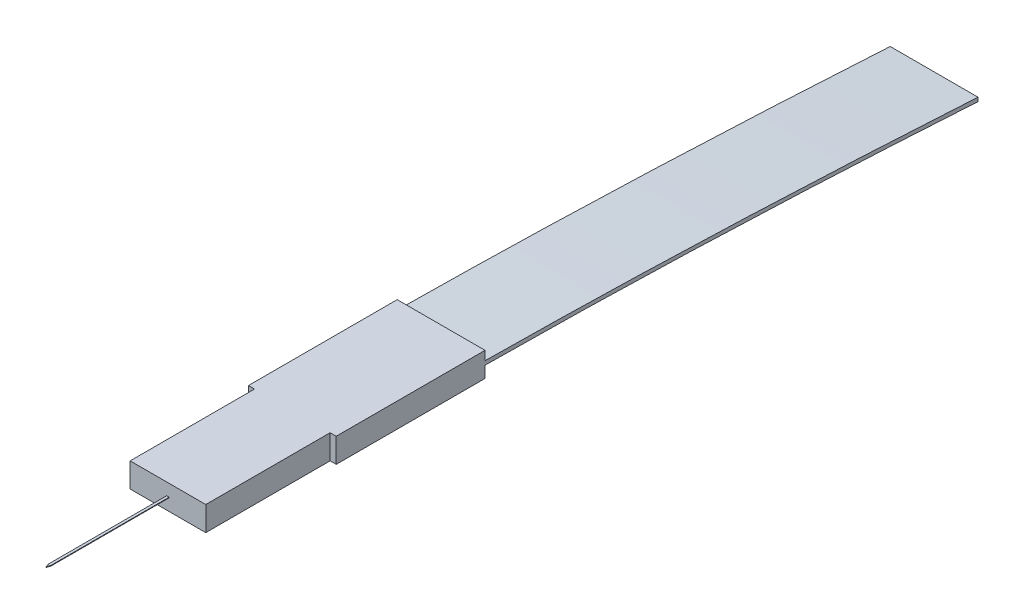
ISO-10303-21;
HEADER;
FILE_DESCRIPTION(('STEP AP214'),'2;1');
FILE_NAME('part.step','',(''),(''),'','','');
FILE_SCHEMA(('AUTOMOTIVE_DESIGN { 1 0 10303 214 1 1 1 1 }'));
ENDSEC;
DATA;
#1=APPLICATION_CONTEXT('core data for automotive mechanical design processes');
#2=APPLICATION_PROTOCOL_DEFINITION('international standard','automotive_design',2000,#1);
#3=PRODUCT_CONTEXT('',#1,'mechanical');
#4=PRODUCT('Part','Part','',(#3));
#5=PRODUCT_RELATED_PRODUCT_CATEGORY('part','',(#4));
#6=PRODUCT_DEFINITION_FORMATION('','',#4);
#7=PRODUCT_DEFINITION_CONTEXT('part definition',#1,'design');
#8=PRODUCT_DEFINITION('design','',#6,#7);
#9=PRODUCT_DEFINITION_SHAPE('','',#8);
#10=(LENGTH_UNIT() NAMED_UNIT(*) SI_UNIT(.MILLI.,.METRE.));
#11=(NAMED_UNIT(*) PLANE_ANGLE_UNIT() SI_UNIT($,.RADIAN.));
#12=(NAMED_UNIT(*) SI_UNIT($,.STERADIAN.) SOLID_ANGLE_UNIT());
#13=UNCERTAINTY_MEASURE_WITH_UNIT(LENGTH_MEASURE(1.E-05),#10,'distance_accuracy_value','');
#14=(GEOMETRIC_REPRESENTATION_CONTEXT(3) GLOBAL_UNCERTAINTY_ASSIGNED_CONTEXT((#13)) GLOBAL_UNIT_ASSIGNED_CONTEXT((#10,
#11,#12)) REPRESENTATION_CONTEXT('',''));
#15=CARTESIAN_POINT('',(0.,0.,0.));
#16=DIRECTION('',(0.,0.,1.));
#17=DIRECTION('',(1.,0.,0.));
#18=AXIS2_PLACEMENT_3D('',#15,#16,#17);
#19=CARTESIAN_POINT('',(0.,2.,-6.1));
#20=DIRECTION('',(0.,0.,-1.));
#21=DIRECTION('',(-1.,0.,0.));
#22=AXIS2_PLACEMENT_3D('',#19,#20,#21);
#23=PLANE('',#22);
#24=DIRECTION('',(0.,-1.,0.));
#25=VECTOR('',#24,1.);
#26=CARTESIAN_POINT('',(-3.6,2.,-6.1));
#27=LINE('',#26,#25);
#28=CARTESIAN_POINT('',(-3.6,0.94234822080572,-6.1));
#29=VERTEX_POINT('',#28);
#30=CARTESIAN_POINT('',(-3.6,0.,-6.1));
#31=VERTEX_POINT('',#30);
#32=EDGE_CURVE('E207',#29,#31,#27,.T.);
#33=ORIENTED_EDGE('',*,*,#32,.F.);
#34=DIRECTION('',(1.,0.,0.));
#35=VECTOR('',#34,1.);
#36=CARTESIAN_POINT('',(-3.6,0.94234822080572,-6.1));
#37=LINE('',#36,#35);
#38=CARTESIAN_POINT('',(3.6,0.94234822080572,-6.1));
#39=VERTEX_POINT('',#38);
#40=EDGE_CURVE('E198',#29,#39,#37,.T.);
#41=ORIENTED_EDGE('',*,*,#40,.T.);
#42=DIRECTION('',(0.,-1.,0.));
#43=VECTOR('',#42,1.);
#44=CARTESIAN_POINT('',(3.6,2.,-6.1));
#45=LINE('',#44,#43);
#46=CARTESIAN_POINT('',(3.6,0.,-6.1));
#47=VERTEX_POINT('',#46);
#48=EDGE_CURVE('E206',#39,#47,#45,.T.);
#49=ORIENTED_EDGE('',*,*,#48,.T.);
#50=DIRECTION('',(1.,0.,0.));
#51=VECTOR('',#50,1.);
#52=CARTESIAN_POINT('',(0.,0.,-6.1));
#53=LINE('',#52,#51);
#54=EDGE_CURVE('E250',#31,#47,#53,.T.);
#55=ORIENTED_EDGE('',*,*,#54,.F.);
#56=EDGE_LOOP('',(#33,#41,#49,#55));
#57=FACE_BOUND('',#56,.T.);
#58=ADVANCED_FACE('F56',(#57),#23,.T.);
#59=CARTESIAN_POINT('',(0.,2.,16.3));
#60=DIRECTION('',(0.,0.,-1.));
#61=DIRECTION('',(-1.,0.,0.));
#62=AXIS2_PLACEMENT_3D('',#59,#60,#61);
#63=PLANE('',#62);
#64=DIRECTION('',(1.,0.,0.));
#65=VECTOR('',#64,1.);
#66=CARTESIAN_POINT('',(0.,0.,16.3));
#67=LINE('',#66,#65);
#68=CARTESIAN_POINT('',(-3.1,0.,16.3));
#69=VERTEX_POINT('',#68);
#70=CARTESIAN_POINT('',(3.1,0.,16.3));
#71=VERTEX_POINT('',#70);
#72=EDGE_CURVE('E229',#69,#71,#67,.T.);
#73=ORIENTED_EDGE('',*,*,#72,.T.);
#74=DIRECTION('',(0.,-1.,0.));
#75=VECTOR('',#74,1.);
#76=CARTESIAN_POINT('',(3.1,2.,16.3));
#77=LINE('',#76,#75);
#78=CARTESIAN_POINT('',(3.1,2.,16.3));
#79=VERTEX_POINT('',#78);
#80=EDGE_CURVE('E219',#79,#71,#77,.T.);
#81=ORIENTED_EDGE('',*,*,#80,.F.);
#82=DIRECTION('',(1.,0.,0.));
#83=VECTOR('',#82,1.);
#84=CARTESIAN_POINT('',(0.,2.,16.3));
#85=LINE('',#84,#83);
#86=CARTESIAN_POINT('',(-3.1,2.,16.3));
#87=VERTEX_POINT('',#86);
#88=EDGE_CURVE('E231',#87,#79,#85,.T.);
#89=ORIENTED_EDGE('',*,*,#88,.F.);
#90=DIRECTION('',(0.,-1.,0.));
#91=VECTOR('',#90,1.);
#92=CARTESIAN_POINT('',(-3.1,2.,16.3));
#93=LINE('',#92,#91);
#94=EDGE_CURVE('E64',#87,#69,#93,.T.);
#95=ORIENTED_EDGE('',*,*,#94,.T.);
#96=EDGE_LOOP('',(#73,#81,#89,#95));
#97=FACE_BOUND('',#96,.T.);
#98=DIRECTION('',(0.,1.,0.));
#99=VECTOR('',#98,1.);
#100=CARTESIAN_POINT('',(0.1,0.975,16.3));
#101=LINE('',#100,#99);
#102=CARTESIAN_POINT('',(0.1,0.975,16.3));
#103=VERTEX_POINT('',#102);
#104=CARTESIAN_POINT('',(0.1,1.025,16.3));
#105=VERTEX_POINT('',#104);
#106=EDGE_CURVE('E323',#103,#105,#101,.T.);
#107=ORIENTED_EDGE('',*,*,#106,.F.);
#108=DIRECTION('',(1.,0.,0.));
#109=VECTOR('',#108,1.);
#110=CARTESIAN_POINT('',(-0.1,0.975,16.3));
#111=LINE('',#110,#109);
#112=CARTESIAN_POINT('',(-0.1,0.975,16.3));
#113=VERTEX_POINT('',#112);
#114=EDGE_CURVE('E331',#113,#103,#111,.T.);
#115=ORIENTED_EDGE('',*,*,#114,.F.);
#116=DIRECTION('',(0.,-1.,0.));
#117=VECTOR('',#116,1.);
#118=CARTESIAN_POINT('',(-0.1,0.975,16.3));
#119=LINE('',#118,#117);
#120=CARTESIAN_POINT('',(-0.1,1.025,16.3));
#121=VERTEX_POINT('',#120);
#122=EDGE_CURVE('E328',#121,#113,#119,.T.);
#123=ORIENTED_EDGE('',*,*,#122,.F.);
#124=DIRECTION('',(-1.,0.,0.));
#125=VECTOR('',#124,1.);
#126=CARTESIAN_POINT('',(-0.1,1.025,16.3));
#127=LINE('',#126,#125);
#128=EDGE_CURVE('E326',#105,#121,#127,.T.);
#129=ORIENTED_EDGE('',*,*,#128,.F.);
#130=EDGE_LOOP('',(#107,#115,#123,#129));
#131=FACE_BOUND('',#130,.T.);
#132=ADVANCED_FACE('F226',(#97,#131),#63,.F.);
#133=CARTESIAN_POINT('',(0.,2.,6.1));
#134=DIRECTION('',(0.,0.,-1.));
#135=DIRECTION('',(-1.,0.,0.));
#136=AXIS2_PLACEMENT_3D('',#133,#134,#135);
#137=PLANE('',#136);
#138=DIRECTION('',(1.,0.,0.));
#139=VECTOR('',#138,1.);
#140=CARTESIAN_POINT('',(0.,0.,6.1));
#141=LINE('',#140,#139);
#142=CARTESIAN_POINT('',(-3.6,0.,6.1));
#143=VERTEX_POINT('',#142);
#144=CARTESIAN_POINT('',(-3.1,0.,6.1));
#145=VERTEX_POINT('',#144);
#146=EDGE_CURVE('E243',#143,#145,#141,.T.);
#147=ORIENTED_EDGE('',*,*,#146,.T.);
#148=DIRECTION('',(0.,-1.,0.));
#149=VECTOR('',#148,1.);
#150=CARTESIAN_POINT('',(-3.1,2.,6.1));
#151=LINE('',#150,#149);
#152=CARTESIAN_POINT('',(-3.1,2.,6.1));
#153=VERTEX_POINT('',#152);
#154=EDGE_CURVE('E12',#153,#145,#151,.T.);
#155=ORIENTED_EDGE('',*,*,#154,.F.);
#156=DIRECTION('',(1.,0.,0.));
#157=VECTOR('',#156,1.);
#158=CARTESIAN_POINT('',(0.,2.,6.1));
#159=LINE('',#158,#157);
#160=CARTESIAN_POINT('',(-3.6,2.,6.1));
#161=VERTEX_POINT('',#160);
#162=EDGE_CURVE('E254',#161,#153,#159,.T.);
#163=ORIENTED_EDGE('',*,*,#162,.F.);
#164=DIRECTION('',(0.,-1.,0.));
#165=VECTOR('',#164,1.);
#166=CARTESIAN_POINT('',(-3.6,2.,6.1));
#167=LINE('',#166,#165);
#168=EDGE_CURVE('E210',#161,#143,#167,.T.);
#169=ORIENTED_EDGE('',*,*,#168,.T.);
#170=EDGE_LOOP('',(#147,#155,#163,#169));
#171=FACE_BOUND('',#170,.T.);
#172=ADVANCED_FACE('F364',(#171),#137,.F.);
#173=CARTESIAN_POINT('',(-3.1,2.,0.));
#174=DIRECTION('',(1.,0.,0.));
#175=DIRECTION('',(0.,0.,-1.));
#176=AXIS2_PLACEMENT_3D('',#173,#174,#175);
#177=PLANE('',#176);
#178=DIRECTION('',(0.,0.,1.));
#179=VECTOR('',#178,1.);
#180=CARTESIAN_POINT('',(-3.1,0.,0.));
#181=LINE('',#180,#179);
#182=EDGE_CURVE('E236',#145,#69,#181,.T.);
#183=ORIENTED_EDGE('',*,*,#182,.T.);
#184=ORIENTED_EDGE('',*,*,#94,.F.);
#185=DIRECTION('',(0.,0.,1.));
#186=VECTOR('',#185,1.);
#187=CARTESIAN_POINT('',(-3.1,2.,0.));
#188=LINE('',#187,#186);
#189=EDGE_CURVE('E256',#153,#87,#188,.T.);
#190=ORIENTED_EDGE('',*,*,#189,.F.);
#191=ORIENTED_EDGE('',*,*,#154,.T.);
#192=EDGE_LOOP('',(#183,#184,#190,#191));
#193=FACE_BOUND('',#192,.T.);
#194=ADVANCED_FACE('F58',(#193),#177,.F.);
#195=CARTESIAN_POINT('',(3.1,2.,0.));
#196=DIRECTION('',(1.,0.,0.));
#197=DIRECTION('',(0.,0.,-1.));
#198=AXIS2_PLACEMENT_3D('',#195,#196,#197);
#199=PLANE('',#198);
#200=DIRECTION('',(0.,0.,1.));
#201=VECTOR('',#200,1.);
#202=CARTESIAN_POINT('',(3.1,0.,0.));
#203=LINE('',#202,#201);
#204=CARTESIAN_POINT('',(3.1,0.,6.1));
#205=VERTEX_POINT('',#204);
#206=EDGE_CURVE('E239',#205,#71,#203,.T.);
#207=ORIENTED_EDGE('',*,*,#206,.F.);
#208=DIRECTION('',(0.,-1.,0.));
#209=VECTOR('',#208,1.);
#210=CARTESIAN_POINT('',(3.1,2.,6.1));
#211=LINE('',#210,#209);
#212=CARTESIAN_POINT('',(3.1,2.,6.1));
#213=VERTEX_POINT('',#212);
#214=EDGE_CURVE('E217',#213,#205,#211,.T.);
#215=ORIENTED_EDGE('',*,*,#214,.F.);
#216=DIRECTION('',(0.,0.,1.));
#217=VECTOR('',#216,1.);
#218=CARTESIAN_POINT('',(3.1,2.,0.));
#219=LINE('',#218,#217);
#220=EDGE_CURVE('E265',#213,#79,#219,.T.);
#221=ORIENTED_EDGE('',*,*,#220,.T.);
#222=ORIENTED_EDGE('',*,*,#80,.T.);
#223=EDGE_LOOP('',(#207,#215,#221,#222));
#224=FACE_BOUND('',#223,.T.);
#225=ADVANCED_FACE('F376',(#224),#199,.T.);
#226=CARTESIAN_POINT('',(3.6,0.,6.1));
#227=VERTEX_POINT('',#226);
#228=EDGE_CURVE('E241',#205,#227,#141,.T.);
#229=ORIENTED_EDGE('',*,*,#228,.T.);
#230=DIRECTION('',(0.,-1.,0.));
#231=VECTOR('',#230,1.);
#232=CARTESIAN_POINT('',(3.6,2.,6.1));
#233=LINE('',#232,#231);
#234=CARTESIAN_POINT('',(3.6,2.,6.1));
#235=VERTEX_POINT('',#234);
#236=EDGE_CURVE('E214',#235,#227,#233,.T.);
#237=ORIENTED_EDGE('',*,*,#236,.F.);
#238=EDGE_CURVE('E258',#213,#235,#159,.T.);
#239=ORIENTED_EDGE('',*,*,#238,.F.);
#240=ORIENTED_EDGE('',*,*,#214,.T.);
#241=EDGE_LOOP('',(#229,#237,#239,#240));
#242=FACE_BOUND('',#241,.T.);
#243=ADVANCED_FACE('F281',(#242),#137,.F.);
#244=CARTESIAN_POINT('',(3.6,2.,0.));
#245=DIRECTION('',(-1.,0.,0.));
#246=DIRECTION('',(0.,0.,1.));
#247=AXIS2_PLACEMENT_3D('',#244,#245,#246);
#248=PLANE('',#247);
#249=DIRECTION('',(0.,0.,-1.));
#250=VECTOR('',#249,1.);
#251=CARTESIAN_POINT('',(3.6,0.,0.));
#252=LINE('',#251,#250);
#253=EDGE_CURVE('E247',#227,#47,#252,.T.);
#254=ORIENTED_EDGE('',*,*,#253,.T.);
#255=ORIENTED_EDGE('',*,*,#48,.F.);
#256=CARTESIAN_POINT('',(3.6,0.94234822080572,-6.1));
#257=CARTESIAN_POINT('',(3.6,0.810344541487121,-24.5183183228742));
#258=CARTESIAN_POINT('',(3.6,-0.554134336022549,-46.5258868403928));
#259=B_SPLINE_CURVE_WITH_KNOTS('',2,(#256,#257,#258),.UNSPECIFIED.,.F.,.F.,(3,3),(0.,1.),.UNSPECIFIED.);
#260=CARTESIAN_POINT('',(3.6,-0.554134336022548,-46.5258868403928));
#261=VERTEX_POINT('',#260);
#262=EDGE_CURVE('E71',#39,#261,#259,.T.);
#263=ORIENTED_EDGE('',*,*,#262,.T.);
#264=DIRECTION('',(0.,1.,0.));
#265=VECTOR('',#264,1.);
#266=CARTESIAN_POINT('',(3.6,-0.234680928592633,-46.5258868403928));
#267=LINE('',#266,#265);
#268=CARTESIAN_POINT('',(3.6,-0.234680928592633,-46.5258868403928));
#269=VERTEX_POINT('',#268);
#270=EDGE_CURVE('E188',#261,#269,#267,.T.);
#271=ORIENTED_EDGE('',*,*,#270,.T.);
#272=CARTESIAN_POINT('',(3.6,-0.234680928592635,-46.5258868403928));
#273=CARTESIAN_POINT('',(3.6,1.083380730753,-24.5624307551034));
#274=CARTESIAN_POINT('',(3.6,1.26180162823563,-6.1));
#275=B_SPLINE_CURVE_WITH_KNOTS('',2,(#272,#273,#274),.UNSPECIFIED.,.F.,.F.,(3,3),(0.,1.),.UNSPECIFIED.);
#276=CARTESIAN_POINT('',(3.6,1.26180162823563,-6.1));
#277=VERTEX_POINT('',#276);
#278=EDGE_CURVE('E292',#269,#277,#275,.T.);
#279=ORIENTED_EDGE('',*,*,#278,.T.);
#280=CARTESIAN_POINT('',(3.6,2.,-6.1));
#281=VERTEX_POINT('',#280);
#282=EDGE_CURVE('E197',#281,#277,#45,.T.);
#283=ORIENTED_EDGE('',*,*,#282,.F.);
#284=DIRECTION('',(0.,0.,-1.));
#285=VECTOR('',#284,1.);
#286=CARTESIAN_POINT('',(3.6,2.,0.));
#287=LINE('',#286,#285);
#288=EDGE_CURVE('E264',#235,#281,#287,.T.);
#289=ORIENTED_EDGE('',*,*,#288,.F.);
#290=ORIENTED_EDGE('',*,*,#236,.T.);
#291=EDGE_LOOP('',(#254,#255,#263,#271,#279,#283,#289,#290));
#292=FACE_BOUND('',#291,.T.);
#293=ADVANCED_FACE('F285',(#292),#248,.F.);
#294=DIRECTION('',(1.,0.,0.));
#295=VECTOR('',#294,1.);
#296=CARTESIAN_POINT('',(-3.6,1.26180162823563,-6.1));
#297=LINE('',#296,#295);
#298=CARTESIAN_POINT('',(-3.6,1.26180162823563,-6.1));
#299=VERTEX_POINT('',#298);
#300=EDGE_CURVE('E180',#299,#277,#297,.T.);
#301=ORIENTED_EDGE('',*,*,#300,.F.);
#302=CARTESIAN_POINT('',(-3.6,2.,-6.1));
#303=VERTEX_POINT('',#302);
#304=EDGE_CURVE('E194',#303,#299,#27,.T.);
#305=ORIENTED_EDGE('',*,*,#304,.F.);
#306=DIRECTION('',(1.,0.,0.));
#307=VECTOR('',#306,1.);
#308=CARTESIAN_POINT('',(0.,2.,-6.1));
#309=LINE('',#308,#307);
#310=EDGE_CURVE('E269',#303,#281,#309,.T.);
#311=ORIENTED_EDGE('',*,*,#310,.T.);
#312=ORIENTED_EDGE('',*,*,#282,.T.);
#313=EDGE_LOOP('',(#301,#305,#311,#312));
#314=FACE_BOUND('',#313,.T.);
#315=ADVANCED_FACE('F192',(#314),#23,.T.);
#316=CARTESIAN_POINT('',(-3.6,2.,0.));
#317=DIRECTION('',(-1.,0.,0.));
#318=DIRECTION('',(0.,0.,1.));
#319=AXIS2_PLACEMENT_3D('',#316,#317,#318);
#320=PLANE('',#319);
#321=DIRECTION('',(0.,0.,-1.));
#322=VECTOR('',#321,1.);
#323=CARTESIAN_POINT('',(-3.6,0.,0.));
#324=LINE('',#323,#322);
#325=EDGE_CURVE('E252',#143,#31,#324,.T.);
#326=ORIENTED_EDGE('',*,*,#325,.F.);
#327=ORIENTED_EDGE('',*,*,#168,.F.);
#328=DIRECTION('',(0.,0.,-1.));
#329=VECTOR('',#328,1.);
#330=CARTESIAN_POINT('',(-3.6,2.,0.));
#331=LINE('',#330,#329);
#332=EDGE_CURVE('E205',#161,#303,#331,.T.);
#333=ORIENTED_EDGE('',*,*,#332,.T.);
#334=ORIENTED_EDGE('',*,*,#304,.T.);
#335=CARTESIAN_POINT('',(-3.6,-0.234680928592635,-46.5258868403928));
#336=CARTESIAN_POINT('',(-3.6,1.083380730753,-24.5624307551034));
#337=CARTESIAN_POINT('',(-3.6,1.26180162823563,-6.1));
#338=B_SPLINE_CURVE_WITH_KNOTS('',2,(#335,#336,#337),.UNSPECIFIED.,.F.,.F.,(3,3),(0.,1.),.UNSPECIFIED.);
#339=CARTESIAN_POINT('',(-3.6,-0.234680928592633,-46.5258868403928));
#340=VERTEX_POINT('',#339);
#341=EDGE_CURVE('E176',#340,#299,#338,.T.);
#342=ORIENTED_EDGE('',*,*,#341,.F.);
#343=DIRECTION('',(0.,1.,0.));
#344=VECTOR('',#343,1.);
#345=CARTESIAN_POINT('',(-3.6,-0.234680928592633,-46.5258868403928));
#346=LINE('',#345,#344);
#347=CARTESIAN_POINT('',(-3.6,-0.554134336022548,-46.5258868403928));
#348=VERTEX_POINT('',#347);
#349=EDGE_CURVE('E199',#348,#340,#346,.T.);
#350=ORIENTED_EDGE('',*,*,#349,.F.);
#351=CARTESIAN_POINT('',(-3.6,0.94234822080572,-6.1));
#352=CARTESIAN_POINT('',(-3.6,0.810344541487121,-24.5183183228742));
#353=CARTESIAN_POINT('',(-3.6,-0.554134336022549,-46.5258868403928));
#354=B_SPLINE_CURVE_WITH_KNOTS('',2,(#351,#352,#353),.UNSPECIFIED.,.F.,.F.,(3,3),(0.,1.),.UNSPECIFIED.);
#355=EDGE_CURVE('E187',#29,#348,#354,.T.);
#356=ORIENTED_EDGE('',*,*,#355,.F.);
#357=ORIENTED_EDGE('',*,*,#32,.T.);
#358=EDGE_LOOP('',(#326,#327,#333,#334,#342,#350,#356,#357));
#359=FACE_BOUND('',#358,.T.);
#360=ADVANCED_FACE('F203',(#359),#320,.T.);
#361=CARTESIAN_POINT('',(0.,2.,0.));
#362=DIRECTION('',(0.,1.,0.));
#363=DIRECTION('',(0.,0.,1.));
#364=AXIS2_PLACEMENT_3D('',#361,#362,#363);
#365=PLANE('',#364);
#366=ORIENTED_EDGE('',*,*,#162,.T.);
#367=ORIENTED_EDGE('',*,*,#189,.T.);
#368=ORIENTED_EDGE('',*,*,#88,.T.);
#369=ORIENTED_EDGE('',*,*,#220,.F.);
#370=ORIENTED_EDGE('',*,*,#238,.T.);
#371=ORIENTED_EDGE('',*,*,#288,.T.);
#372=ORIENTED_EDGE('',*,*,#310,.F.);
#373=ORIENTED_EDGE('',*,*,#332,.F.);
#374=EDGE_LOOP('',(#366,#367,#368,#369,#370,#371,#372,#373));
#375=FACE_BOUND('',#374,.T.);
#376=ADVANCED_FACE('F372',(#375),#365,.T.);
#377=CARTESIAN_POINT('',(0.,0.,0.));
#378=DIRECTION('',(0.,1.,0.));
#379=DIRECTION('',(0.,0.,1.));
#380=AXIS2_PLACEMENT_3D('',#377,#378,#379);
#381=PLANE('',#380);
#382=ORIENTED_EDGE('',*,*,#146,.F.);
#383=ORIENTED_EDGE('',*,*,#325,.T.);
#384=ORIENTED_EDGE('',*,*,#54,.T.);
#385=ORIENTED_EDGE('',*,*,#253,.F.);
#386=ORIENTED_EDGE('',*,*,#228,.F.);
#387=ORIENTED_EDGE('',*,*,#206,.T.);
#388=ORIENTED_EDGE('',*,*,#72,.F.);
#389=ORIENTED_EDGE('',*,*,#182,.F.);
#390=EDGE_LOOP('',(#382,#383,#384,#385,#386,#387,#388,#389));
#391=FACE_BOUND('',#390,.T.);
#392=ADVANCED_FACE('F235',(#391),#381,.F.);
#393=CARTESIAN_POINT('',(0.1,0.975,26.3));
#394=DIRECTION('',(-1.,0.,0.));
#395=DIRECTION('',(0.,0.,1.));
#396=AXIS2_PLACEMENT_3D('',#393,#394,#395);
#397=PLANE('',#396);
#398=DIRECTION('',(0.,0.,-1.));
#399=VECTOR('',#398,1.);
#400=CARTESIAN_POINT('',(0.1,1.025,26.3));
#401=LINE('',#400,#399);
#402=CARTESIAN_POINT('',(0.100000000000001,1.025,26.));
#403=VERTEX_POINT('',#402);
#404=EDGE_CURVE('E79',#403,#105,#401,.T.);
#405=ORIENTED_EDGE('',*,*,#404,.F.);
#406=DIRECTION('',(0.,-1.,0.));
#407=VECTOR('',#406,1.);
#408=CARTESIAN_POINT('',(0.100000000000001,1.34122776601685,26.));
#409=LINE('',#408,#407);
#410=CARTESIAN_POINT('',(0.100000000000001,0.975,26.));
#411=VERTEX_POINT('',#410);
#412=EDGE_CURVE('E315',#403,#411,#409,.T.);
#413=ORIENTED_EDGE('',*,*,#412,.T.);
#414=DIRECTION('',(0.,0.,-1.));
#415=VECTOR('',#414,1.);
#416=CARTESIAN_POINT('',(0.1,0.975,26.3));
#417=LINE('',#416,#415);
#418=EDGE_CURVE('E334',#411,#103,#417,.T.);
#419=ORIENTED_EDGE('',*,*,#418,.T.);
#420=ORIENTED_EDGE('',*,*,#106,.T.);
#421=EDGE_LOOP('',(#405,#413,#419,#420));
#422=FACE_BOUND('',#421,.T.);
#423=ADVANCED_FACE('F349',(#422),#397,.F.);
#424=CARTESIAN_POINT('',(-0.1,1.025,26.3));
#425=DIRECTION('',(0.,-1.,0.));
#426=DIRECTION('',(0.,0.,-1.));
#427=AXIS2_PLACEMENT_3D('',#424,#425,#426);
#428=PLANE('',#427);
#429=DIRECTION('',(0.,0.,-1.));
#430=VECTOR('',#429,1.);
#431=CARTESIAN_POINT('',(-0.1,1.025,26.3));
#432=LINE('',#431,#430);
#433=CARTESIAN_POINT('',(-0.100000000000002,1.025,26.));
#434=VERTEX_POINT('',#433);
#435=EDGE_CURVE('E279',#434,#121,#432,.T.);
#436=ORIENTED_EDGE('',*,*,#435,.F.);
#437=DIRECTION('',(-0.316227766016836,0.,-0.948683298050514));
#438=VECTOR('',#437,1.);
#439=CARTESIAN_POINT('',(-7.88999999999997,1.025,2.62999999999997));
#440=LINE('',#439,#438);
#441=CARTESIAN_POINT('',(0.,1.025,26.3));
#442=VERTEX_POINT('',#441);
#443=EDGE_CURVE('E307',#442,#434,#440,.T.);
#444=ORIENTED_EDGE('',*,*,#443,.F.);
#445=DIRECTION('',(-0.316227766016836,0.,0.948683298050514));
#446=VECTOR('',#445,1.);
#447=CARTESIAN_POINT('',(7.88999999999997,1.025,2.62999999999997));
#448=LINE('',#447,#446);
#449=EDGE_CURVE('E318',#403,#442,#448,.T.);
#450=ORIENTED_EDGE('',*,*,#449,.F.);
#451=ORIENTED_EDGE('',*,*,#404,.T.);
#452=ORIENTED_EDGE('',*,*,#128,.T.);
#453=EDGE_LOOP('',(#436,#444,#450,#451,#452));
#454=FACE_BOUND('',#453,.T.);
#455=ADVANCED_FACE('F347',(#454),#428,.F.);
#456=CARTESIAN_POINT('',(-0.1,0.975,26.3));
#457=DIRECTION('',(1.,0.,0.));
#458=DIRECTION('',(0.,0.,-1.));
#459=AXIS2_PLACEMENT_3D('',#456,#457,#458);
#460=PLANE('',#459);
#461=DIRECTION('',(0.,0.,-1.));
#462=VECTOR('',#461,1.);
#463=CARTESIAN_POINT('',(-0.1,0.975,26.3));
#464=LINE('',#463,#462);
#465=CARTESIAN_POINT('',(-0.100000000000001,0.975,26.));
#466=VERTEX_POINT('',#465);
#467=EDGE_CURVE('E336',#466,#113,#464,.T.);
#468=ORIENTED_EDGE('',*,*,#467,.F.);
#469=DIRECTION('',(0.,-1.,0.));
#470=VECTOR('',#469,1.);
#471=CARTESIAN_POINT('',(-0.100000000000001,1.34122776601685,26.));
#472=LINE('',#471,#470);
#473=EDGE_CURVE('E304',#434,#466,#472,.T.);
#474=ORIENTED_EDGE('',*,*,#473,.F.);
#475=ORIENTED_EDGE('',*,*,#435,.T.);
#476=ORIENTED_EDGE('',*,*,#122,.T.);
#477=EDGE_LOOP('',(#468,#474,#475,#476));
#478=FACE_BOUND('',#477,.T.);
#479=ADVANCED_FACE('F343',(#478),#460,.F.);
#480=CARTESIAN_POINT('',(-0.1,0.975,26.3));
#481=DIRECTION('',(0.,1.,0.));
#482=DIRECTION('',(0.,0.,1.));
#483=AXIS2_PLACEMENT_3D('',#480,#481,#482);
#484=PLANE('',#483);
#485=DIRECTION('',(0.316227766016836,0.,-0.948683298050514));
#486=VECTOR('',#485,1.);
#487=CARTESIAN_POINT('',(7.88999999999997,0.975,2.62999999999997));
#488=LINE('',#487,#486);
#489=CARTESIAN_POINT('',(0.,0.975,26.3));
#490=VERTEX_POINT('',#489);
#491=EDGE_CURVE('E309',#490,#411,#488,.T.);
#492=ORIENTED_EDGE('',*,*,#491,.F.);
#493=DIRECTION('',(0.316227766016836,0.,0.948683298050514));
#494=VECTOR('',#493,1.);
#495=CARTESIAN_POINT('',(-7.88999999999997,0.975,2.62999999999997));
#496=LINE('',#495,#494);
#497=EDGE_CURVE('E310',#466,#490,#496,.T.);
#498=ORIENTED_EDGE('',*,*,#497,.F.);
#499=ORIENTED_EDGE('',*,*,#467,.T.);
#500=ORIENTED_EDGE('',*,*,#114,.T.);
#501=ORIENTED_EDGE('',*,*,#418,.F.);
#502=EDGE_LOOP('',(#492,#498,#499,#500,#501));
#503=FACE_BOUND('',#502,.T.);
#504=ADVANCED_FACE('F355',(#503),#484,.F.);
#505=CARTESIAN_POINT('',(7.88999999999997,1.34122776601685,2.62999999999997));
#506=DIRECTION('',(-0.948683298050514,0.,-0.316227766016836));
#507=DIRECTION('',(-0.316227766016836,0.,0.948683298050514));
#508=AXIS2_PLACEMENT_3D('',#505,#506,#507);
#509=PLANE('',#508);
#510=ORIENTED_EDGE('',*,*,#449,.T.);
#511=DIRECTION('',(0.,-1.,0.));
#512=VECTOR('',#511,1.);
#513=CARTESIAN_POINT('',(0.,1.34122776601685,26.3));
#514=LINE('',#513,#512);
#515=EDGE_CURVE('E314',#442,#490,#514,.T.);
#516=ORIENTED_EDGE('',*,*,#515,.T.);
#517=ORIENTED_EDGE('',*,*,#491,.T.);
#518=ORIENTED_EDGE('',*,*,#412,.F.);
#519=EDGE_LOOP('',(#510,#516,#517,#518));
#520=FACE_BOUND('',#519,.T.);
#521=ADVANCED_FACE('F409',(#520),#509,.F.);
#522=CARTESIAN_POINT('',(-7.88999999999997,1.34122776601685,2.62999999999997));
#523=DIRECTION('',(0.948683298050514,0.,-0.316227766016836));
#524=DIRECTION('',(-0.316227766016836,0.,-0.948683298050514));
#525=AXIS2_PLACEMENT_3D('',#522,#523,#524);
#526=PLANE('',#525);
#527=ORIENTED_EDGE('',*,*,#443,.T.);
#528=ORIENTED_EDGE('',*,*,#473,.T.);
#529=ORIENTED_EDGE('',*,*,#497,.T.);
#530=ORIENTED_EDGE('',*,*,#515,.F.);
#531=EDGE_LOOP('',(#527,#528,#529,#530));
#532=FACE_BOUND('',#531,.T.);
#533=ADVANCED_FACE('F406',(#532),#526,.F.);
#534=DIRECTION('',(1.,0.,0.));
#535=VECTOR('',#534,1.);
#536=SURFACE_OF_LINEAR_EXTRUSION('',#338,#535);
#537=ORIENTED_EDGE('',*,*,#278,.F.);
#538=DIRECTION('',(1.,0.,0.));
#539=VECTOR('',#538,1.);
#540=CARTESIAN_POINT('',(-3.6,-0.234680928592633,-46.5258868403928));
#541=LINE('',#540,#539);
#542=EDGE_CURVE('E182',#340,#269,#541,.T.);
#543=ORIENTED_EDGE('',*,*,#542,.F.);
#544=ORIENTED_EDGE('',*,*,#341,.T.);
#545=ORIENTED_EDGE('',*,*,#300,.T.);
#546=EDGE_LOOP('',(#537,#543,#544,#545));
#547=FACE_BOUND('',#546,.T.);
#548=ADVANCED_FACE('F179',(#547),#536,.T.);
#549=CARTESIAN_POINT('',(-3.6,-0.234680928592633,-46.5258868403928));
#550=DIRECTION('',(0.,0.,-1.));
#551=DIRECTION('',(-1.,0.,0.));
#552=AXIS2_PLACEMENT_3D('',#549,#550,#551);
#553=PLANE('',#552);
#554=ORIENTED_EDGE('',*,*,#270,.F.);
#555=DIRECTION('',(1.,0.,0.));
#556=VECTOR('',#555,1.);
#557=CARTESIAN_POINT('',(-3.6,-0.554134336022548,-46.5258868403928));
#558=LINE('',#557,#556);
#559=EDGE_CURVE('E296',#348,#261,#558,.T.);
#560=ORIENTED_EDGE('',*,*,#559,.F.);
#561=ORIENTED_EDGE('',*,*,#349,.T.);
#562=ORIENTED_EDGE('',*,*,#542,.T.);
#563=EDGE_LOOP('',(#554,#560,#561,#562));
#564=FACE_BOUND('',#563,.T.);
#565=ADVANCED_FACE('F295',(#564),#553,.T.);
#566=DIRECTION('',(1.,0.,0.));
#567=VECTOR('',#566,1.);
#568=SURFACE_OF_LINEAR_EXTRUSION('',#354,#567);
#569=ORIENTED_EDGE('',*,*,#262,.F.);
#570=ORIENTED_EDGE('',*,*,#40,.F.);
#571=ORIENTED_EDGE('',*,*,#355,.T.);
#572=ORIENTED_EDGE('',*,*,#559,.T.);
#573=EDGE_LOOP('',(#569,#570,#571,#572));
#574=FACE_BOUND('',#573,.T.);
#575=ADVANCED_FACE('F400',(#574),#568,.T.);
#576=CLOSED_SHELL('',(#58,#132,#172,#194,#225,#243,#293,#315,#360,#376,#392,#423,#455,#479,#504,
#521,#533,#548,#565,#575));
#577=MANIFOLD_SOLID_BREP('B2',#576);
#578=ADVANCED_BREP_SHAPE_REPRESENTATION('',(#18,#577),#14);
#579=SHAPE_DEFINITION_REPRESENTATION(#9,#578);
ENDSEC;
END-ISO-10303-21;
